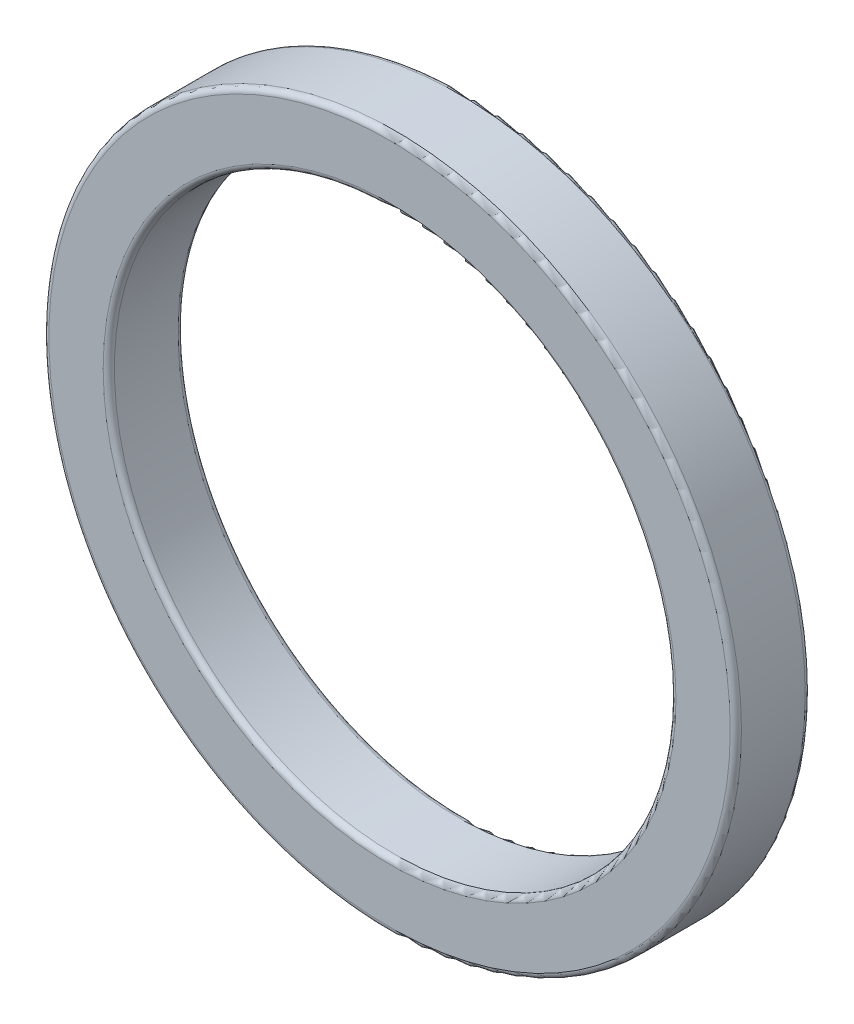
ISO-10303-21;
HEADER;
FILE_DESCRIPTION(('STEP AP214'),'2;1');
FILE_NAME('part.step','',(''),(''),'','','');
FILE_SCHEMA(('AUTOMOTIVE_DESIGN { 1 0 10303 214 1 1 1 1 }'));
ENDSEC;
DATA;
#1=APPLICATION_CONTEXT('core data for automotive mechanical design processes');
#2=APPLICATION_PROTOCOL_DEFINITION('international standard','automotive_design',2000,#1);
#3=PRODUCT_CONTEXT('',#1,'mechanical');
#4=PRODUCT('Part','Part','',(#3));
#5=PRODUCT_RELATED_PRODUCT_CATEGORY('part','',(#4));
#6=PRODUCT_DEFINITION_FORMATION('','',#4);
#7=PRODUCT_DEFINITION_CONTEXT('part definition',#1,'design');
#8=PRODUCT_DEFINITION('design','',#6,#7);
#9=PRODUCT_DEFINITION_SHAPE('','',#8);
#10=(LENGTH_UNIT() NAMED_UNIT(*) SI_UNIT(.MILLI.,.METRE.));
#11=(NAMED_UNIT(*) PLANE_ANGLE_UNIT() SI_UNIT($,.RADIAN.));
#12=(NAMED_UNIT(*) SI_UNIT($,.STERADIAN.) SOLID_ANGLE_UNIT());
#13=UNCERTAINTY_MEASURE_WITH_UNIT(LENGTH_MEASURE(1.E-05),#10,'distance_accuracy_value','');
#14=(GEOMETRIC_REPRESENTATION_CONTEXT(3) GLOBAL_UNCERTAINTY_ASSIGNED_CONTEXT((#13)) GLOBAL_UNIT_ASSIGNED_CONTEXT((#10,
#11,#12)) REPRESENTATION_CONTEXT('',''));
#15=CARTESIAN_POINT('',(0.,0.,0.));
#16=DIRECTION('',(0.,0.,1.));
#17=DIRECTION('',(1.,0.,0.));
#18=AXIS2_PLACEMENT_3D('',#15,#16,#17);
#19=CARTESIAN_POINT('',(0.,0.,4.));
#20=DIRECTION('',(0.,0.,1.));
#21=DIRECTION('',(1.,0.,0.));
#22=AXIS2_PLACEMENT_3D('',#19,#20,#21);
#23=PLANE('',#22);
#24=CARTESIAN_POINT('',(0.,0.,4.));
#25=DIRECTION('',(0.,0.,1.));
#26=DIRECTION('',(1.,0.,0.));
#27=AXIS2_PLACEMENT_3D('',#24,#25,#26);
#28=CIRCLE('',#27,15.3);
#29=CARTESIAN_POINT('',(15.3,0.,4.));
#30=VERTEX_POINT('',#29);
#31=EDGE_CURVE('E10',#30,#30,#28,.F.);
#32=ORIENTED_EDGE('',*,*,#31,.T.);
#33=EDGE_LOOP('',(#32));
#34=FACE_BOUND('',#33,.T.);
#35=CARTESIAN_POINT('',(0.,0.,4.));
#36=DIRECTION('',(0.,0.,1.));
#37=DIRECTION('',(1.,0.,0.));
#38=AXIS2_PLACEMENT_3D('',#35,#36,#37);
#39=CIRCLE('',#38,18.2);
#40=CARTESIAN_POINT('',(18.2,0.,4.));
#41=VERTEX_POINT('',#40);
#42=EDGE_CURVE('E39',#41,#41,#39,.T.);
#43=ORIENTED_EDGE('',*,*,#42,.T.);
#44=EDGE_LOOP('',(#43));
#45=FACE_BOUND('',#44,.T.);
#46=ADVANCED_FACE('F32',(#34,#45),#23,.T.);
#47=CARTESIAN_POINT('',(0.,0.,0.));
#48=DIRECTION('',(0.,0.,1.));
#49=DIRECTION('',(1.,0.,0.));
#50=AXIS2_PLACEMENT_3D('',#47,#48,#49);
#51=PLANE('',#50);
#52=CARTESIAN_POINT('',(0.,0.,0.));
#53=DIRECTION('',(0.,0.,1.));
#54=DIRECTION('',(1.,0.,0.));
#55=AXIS2_PLACEMENT_3D('',#52,#53,#54);
#56=CIRCLE('',#55,15.3);
#57=CARTESIAN_POINT('',(15.3,0.,0.));
#58=VERTEX_POINT('',#57);
#59=EDGE_CURVE('E58',#58,#58,#56,.T.);
#60=ORIENTED_EDGE('',*,*,#59,.T.);
#61=EDGE_LOOP('',(#60));
#62=FACE_BOUND('',#61,.T.);
#63=CARTESIAN_POINT('',(0.,0.,0.));
#64=DIRECTION('',(0.,0.,1.));
#65=DIRECTION('',(1.,0.,0.));
#66=AXIS2_PLACEMENT_3D('',#63,#64,#65);
#67=CIRCLE('',#66,18.2);
#68=CARTESIAN_POINT('',(18.2,0.,0.));
#69=VERTEX_POINT('',#68);
#70=EDGE_CURVE('E61',#69,#69,#67,.F.);
#71=ORIENTED_EDGE('',*,*,#70,.T.);
#72=EDGE_LOOP('',(#71));
#73=FACE_BOUND('',#72,.T.);
#74=ADVANCED_FACE('F65',(#62,#73),#51,.F.);
#75=CARTESIAN_POINT('',(0.,0.,4.));
#76=DIRECTION('',(0.,0.,-1.));
#77=DIRECTION('',(-1.,0.,0.));
#78=AXIS2_PLACEMENT_3D('',#75,#76,#77);
#79=CYLINDRICAL_SURFACE('',#78,18.5);
#80=CARTESIAN_POINT('',(0.,0.,0.3));
#81=DIRECTION('',(0.,0.,1.));
#82=DIRECTION('',(1.,0.,0.));
#83=AXIS2_PLACEMENT_3D('',#80,#81,#82);
#84=CIRCLE('',#83,18.5);
#85=CARTESIAN_POINT('',(18.5,0.,0.3));
#86=VERTEX_POINT('',#85);
#87=EDGE_CURVE('E43',#86,#86,#84,.T.);
#88=ORIENTED_EDGE('',*,*,#87,.T.);
#89=EDGE_LOOP('',(#88));
#90=FACE_BOUND('',#89,.T.);
#91=CARTESIAN_POINT('',(0.,0.,3.7));
#92=DIRECTION('',(0.,0.,1.));
#93=DIRECTION('',(1.,0.,0.));
#94=AXIS2_PLACEMENT_3D('',#91,#92,#93);
#95=CIRCLE('',#94,18.5);
#96=CARTESIAN_POINT('',(18.5,0.,3.7));
#97=VERTEX_POINT('',#96);
#98=EDGE_CURVE('E47',#97,#97,#95,.F.);
#99=ORIENTED_EDGE('',*,*,#98,.T.);
#100=EDGE_LOOP('',(#99));
#101=FACE_BOUND('',#100,.T.);
#102=ADVANCED_FACE('F75',(#90,#101),#79,.T.);
#103=CARTESIAN_POINT('',(0.,0.,4.));
#104=DIRECTION('',(0.,0.,-1.));
#105=DIRECTION('',(-1.,0.,0.));
#106=AXIS2_PLACEMENT_3D('',#103,#104,#105);
#107=CYLINDRICAL_SURFACE('',#106,15.);
#108=CARTESIAN_POINT('',(0.,0.,0.3));
#109=DIRECTION('',(0.,0.,1.));
#110=DIRECTION('',(1.,0.,0.));
#111=AXIS2_PLACEMENT_3D('',#108,#109,#110);
#112=CIRCLE('',#111,15.);
#113=CARTESIAN_POINT('',(15.,0.,0.3));
#114=VERTEX_POINT('',#113);
#115=EDGE_CURVE('E52',#114,#114,#112,.F.);
#116=ORIENTED_EDGE('',*,*,#115,.T.);
#117=EDGE_LOOP('',(#116));
#118=FACE_BOUND('',#117,.T.);
#119=CARTESIAN_POINT('',(0.,0.,3.7));
#120=DIRECTION('',(0.,0.,1.));
#121=DIRECTION('',(1.,0.,0.));
#122=AXIS2_PLACEMENT_3D('',#119,#120,#121);
#123=CIRCLE('',#122,15.);
#124=CARTESIAN_POINT('',(15.,0.,3.7));
#125=VERTEX_POINT('',#124);
#126=EDGE_CURVE('E55',#125,#125,#123,.T.);
#127=ORIENTED_EDGE('',*,*,#126,.T.);
#128=EDGE_LOOP('',(#127));
#129=FACE_BOUND('',#128,.T.);
#130=ADVANCED_FACE('F78',(#118,#129),#107,.F.);
#131=CARTESIAN_POINT('',(0.,0.,0.3));
#132=DIRECTION('',(0.,0.,1.));
#133=DIRECTION('',(1.,0.,0.));
#134=AXIS2_PLACEMENT_3D('',#131,#132,#133);
#135=TOROIDAL_SURFACE('',#134,15.3,0.3);
#136=ORIENTED_EDGE('',*,*,#115,.F.);
#137=EDGE_LOOP('',(#136));
#138=FACE_BOUND('',#137,.T.);
#139=ORIENTED_EDGE('',*,*,#59,.F.);
#140=EDGE_LOOP('',(#139));
#141=FACE_BOUND('',#140,.T.);
#142=ADVANCED_FACE('F71',(#138,#141),#135,.T.);
#143=CARTESIAN_POINT('',(0.,0.,0.3));
#144=DIRECTION('',(0.,0.,1.));
#145=DIRECTION('',(1.,0.,0.));
#146=AXIS2_PLACEMENT_3D('',#143,#144,#145);
#147=TOROIDAL_SURFACE('',#146,18.2,0.3);
#148=ORIENTED_EDGE('',*,*,#70,.F.);
#149=EDGE_LOOP('',(#148));
#150=FACE_BOUND('',#149,.T.);
#151=ORIENTED_EDGE('',*,*,#87,.F.);
#152=EDGE_LOOP('',(#151));
#153=FACE_BOUND('',#152,.T.);
#154=ADVANCED_FACE('F67',(#150,#153),#147,.T.);
#155=CARTESIAN_POINT('',(0.,0.,3.7));
#156=DIRECTION('',(0.,0.,1.));
#157=DIRECTION('',(1.,0.,0.));
#158=AXIS2_PLACEMENT_3D('',#155,#156,#157);
#159=TOROIDAL_SURFACE('',#158,15.3,0.3);
#160=ORIENTED_EDGE('',*,*,#31,.F.);
#161=EDGE_LOOP('',(#160));
#162=FACE_BOUND('',#161,.T.);
#163=ORIENTED_EDGE('',*,*,#126,.F.);
#164=EDGE_LOOP('',(#163));
#165=FACE_BOUND('',#164,.T.);
#166=ADVANCED_FACE('F70',(#162,#165),#159,.T.);
#167=CARTESIAN_POINT('',(0.,0.,3.7));
#168=DIRECTION('',(0.,0.,1.));
#169=DIRECTION('',(1.,0.,0.));
#170=AXIS2_PLACEMENT_3D('',#167,#168,#169);
#171=TOROIDAL_SURFACE('',#170,18.2,0.3);
#172=ORIENTED_EDGE('',*,*,#98,.F.);
#173=EDGE_LOOP('',(#172));
#174=FACE_BOUND('',#173,.T.);
#175=ORIENTED_EDGE('',*,*,#42,.F.);
#176=EDGE_LOOP('',(#175));
#177=FACE_BOUND('',#176,.T.);
#178=ADVANCED_FACE('F34',(#174,#177),#171,.T.);
#179=CLOSED_SHELL('',(#46,#74,#102,#130,#142,#154,#166,#178));
#180=MANIFOLD_SOLID_BREP('B2',#179);
#181=ADVANCED_BREP_SHAPE_REPRESENTATION('',(#18,#180),#14);
#182=SHAPE_DEFINITION_REPRESENTATION(#9,#181);
ENDSEC;
END-ISO-10303-21;
